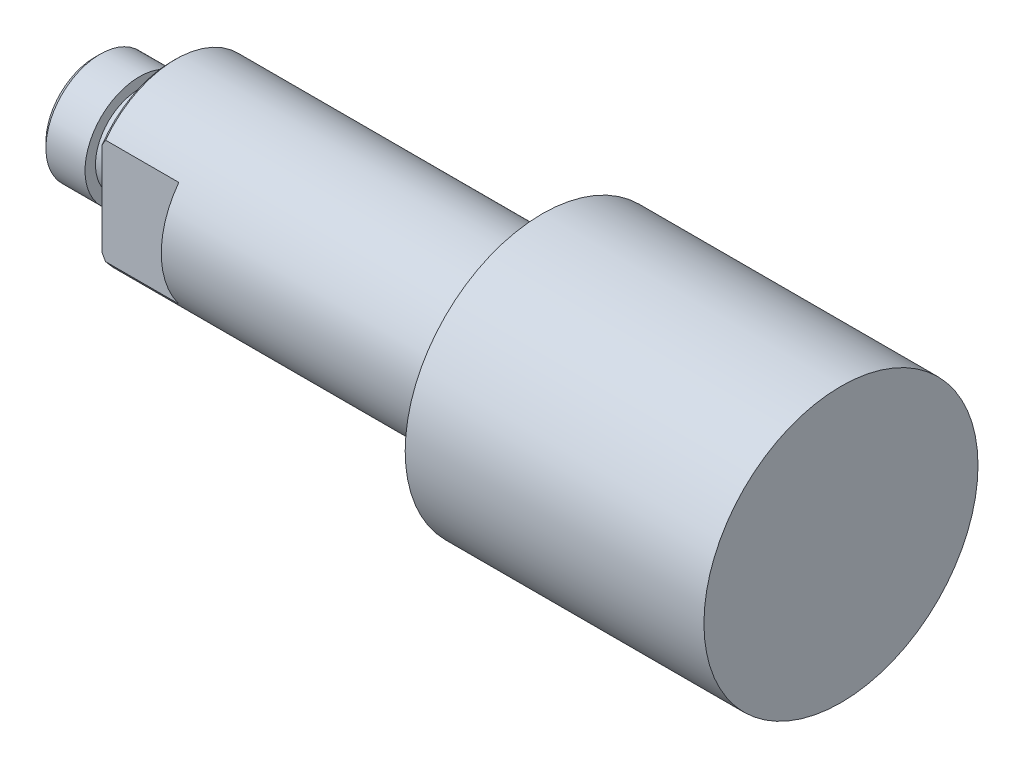
ISO-10303-21;
HEADER;
FILE_DESCRIPTION(('STEP AP214'),'2;1');
FILE_NAME('part.step','',(''),(''),'','','');
FILE_SCHEMA(('AUTOMOTIVE_DESIGN { 1 0 10303 214 1 1 1 1 }'));
ENDSEC;
DATA;
#1=APPLICATION_CONTEXT('core data for automotive mechanical design processes');
#2=APPLICATION_PROTOCOL_DEFINITION('international standard','automotive_design',2000,#1);
#3=PRODUCT_CONTEXT('',#1,'mechanical');
#4=PRODUCT('Part','Part','',(#3));
#5=PRODUCT_RELATED_PRODUCT_CATEGORY('part','',(#4));
#6=PRODUCT_DEFINITION_FORMATION('','',#4);
#7=PRODUCT_DEFINITION_CONTEXT('part definition',#1,'design');
#8=PRODUCT_DEFINITION('design','',#6,#7);
#9=PRODUCT_DEFINITION_SHAPE('','',#8);
#10=(LENGTH_UNIT() NAMED_UNIT(*) SI_UNIT(.MILLI.,.METRE.));
#11=(NAMED_UNIT(*) PLANE_ANGLE_UNIT() SI_UNIT($,.RADIAN.));
#12=(NAMED_UNIT(*) SI_UNIT($,.STERADIAN.) SOLID_ANGLE_UNIT());
#13=UNCERTAINTY_MEASURE_WITH_UNIT(LENGTH_MEASURE(1.E-05),#10,'distance_accuracy_value','');
#14=(GEOMETRIC_REPRESENTATION_CONTEXT(3) GLOBAL_UNCERTAINTY_ASSIGNED_CONTEXT((#13)) GLOBAL_UNIT_ASSIGNED_CONTEXT((#10,
#11,#12)) REPRESENTATION_CONTEXT('',''));
#15=CARTESIAN_POINT('',(0.,0.,0.));
#16=DIRECTION('',(0.,0.,1.));
#17=DIRECTION('',(1.,0.,0.));
#18=AXIS2_PLACEMENT_3D('',#15,#16,#17);
#19=CARTESIAN_POINT('',(7.,0.,0.));
#20=DIRECTION('',(1.,0.,0.));
#21=DIRECTION('',(0.,1.,0.));
#22=AXIS2_PLACEMENT_3D('',#19,#20,#21);
#23=PLANE('',#22);
#24=DIRECTION('',(0.,-1.,0.));
#25=VECTOR('',#24,1.);
#26=CARTESIAN_POINT('',(7.,8.,6.4));
#27=LINE('',#26,#25);
#28=CARTESIAN_POINT('',(7.,4.8,6.4));
#29=VERTEX_POINT('',#28);
#30=CARTESIAN_POINT('',(7.,-4.8,6.4));
#31=VERTEX_POINT('',#30);
#32=EDGE_CURVE('E11',#29,#31,#27,.T.);
#33=ORIENTED_EDGE('',*,*,#32,.T.);
#34=CARTESIAN_POINT('',(7.,0.,0.));
#35=DIRECTION('',(1.,0.,0.));
#36=DIRECTION('',(0.,0.,-1.));
#37=AXIS2_PLACEMENT_3D('',#34,#35,#36);
#38=CIRCLE('',#37,8.);
#39=EDGE_CURVE('E192',#29,#31,#38,.T.);
#40=ORIENTED_EDGE('',*,*,#39,.F.);
#41=EDGE_LOOP('',(#33,#40));
#42=FACE_BOUND('',#41,.T.);
#43=ADVANCED_FACE('F16',(#42),#23,.F.);
#44=CARTESIAN_POINT('',(7.,8.,6.4));
#45=DIRECTION('',(0.,0.,-1.));
#46=DIRECTION('',(0.,-1.,0.));
#47=AXIS2_PLACEMENT_3D('',#44,#45,#46);
#48=PLANE('',#47);
#49=DIRECTION('',(0.,-1.,0.));
#50=VECTOR('',#49,1.);
#51=CARTESIAN_POINT('',(0.,8.,6.4));
#52=LINE('',#51,#50);
#53=CARTESIAN_POINT('',(0.,4.24527973165491,6.4));
#54=VERTEX_POINT('',#53);
#55=CARTESIAN_POINT('',(0.,-4.24527973165491,6.4));
#56=VERTEX_POINT('',#55);
#57=EDGE_CURVE('E181',#54,#56,#52,.T.);
#58=ORIENTED_EDGE('',*,*,#57,.T.);
#59=CARTESIAN_POINT('',(0.32,-4.8,6.4));
#60=CARTESIAN_POINT('',(0.20996321902832,-4.6166053650472,6.4));
#61=CARTESIAN_POINT('',(0.103096522960072,-4.43178835920881,6.4));
#62=CARTESIAN_POINT('',(0.,-4.24527973165491,6.4));
#63=(BOUNDED_CURVE() B_SPLINE_CURVE(3,(#59,#60,#61,#62),.UNSPECIFIED.,.F.,
.F.) B_SPLINE_CURVE_WITH_KNOTS((4,4),(1.35090557365412E-06,0.000638458369954126),
.UNSPECIFIED.) CURVE() GEOMETRIC_REPRESENTATION_ITEM() RATIONAL_B_SPLINE_CURVE((1.,1.,1.,1.)) REPRESENTATION_ITEM(''));
#64=CARTESIAN_POINT('',(0.32,-4.8,6.4));
#65=VERTEX_POINT('',#64);
#66=EDGE_CURVE('E344',#65,#56,#63,.T.);
#67=ORIENTED_EDGE('',*,*,#66,.F.);
#68=DIRECTION('',(-1.,0.,0.));
#69=VECTOR('',#68,1.);
#70=CARTESIAN_POINT('',(61.,-4.8,6.4));
#71=LINE('',#70,#69);
#72=EDGE_CURVE('E185',#31,#65,#71,.T.);
#73=ORIENTED_EDGE('',*,*,#72,.F.);
#74=ORIENTED_EDGE('',*,*,#32,.F.);
#75=DIRECTION('',(1.,0.,0.));
#76=VECTOR('',#75,1.);
#77=CARTESIAN_POINT('',(61.,4.8,6.4));
#78=LINE('',#77,#76);
#79=CARTESIAN_POINT('',(0.32,4.8,6.4));
#80=VERTEX_POINT('',#79);
#81=EDGE_CURVE('E222',#80,#29,#78,.T.);
#82=ORIENTED_EDGE('',*,*,#81,.F.);
#83=CARTESIAN_POINT('',(0.,4.24527973165494,6.4));
#84=CARTESIAN_POINT('',(0.10318239744357,4.43194371199482,6.4));
#85=CARTESIAN_POINT('',(0.210049599241936,4.61674933206989,6.4));
#86=CARTESIAN_POINT('',(0.32,4.8,6.4));
#87=(BOUNDED_CURVE() B_SPLINE_CURVE(3,(#83,#84,#85,#86),.UNSPECIFIED.,.F.,
.F.) B_SPLINE_CURVE_WITH_KNOTS((4,4),(0.00955860477936685,0.0101932153989926),
.UNSPECIFIED.) CURVE() GEOMETRIC_REPRESENTATION_ITEM() RATIONAL_B_SPLINE_CURVE((1.,1.,1.,1.)) REPRESENTATION_ITEM(''));
#88=EDGE_CURVE('E151',#54,#80,#87,.T.);
#89=ORIENTED_EDGE('',*,*,#88,.F.);
#90=EDGE_LOOP('',(#58,#67,#73,#74,#82,#89));
#91=FACE_BOUND('',#90,.T.);
#92=ADVANCED_FACE('F279',(#91),#48,.F.);
#93=CARTESIAN_POINT('',(7.,-8.,-6.4));
#94=DIRECTION('',(0.,0.,1.));
#95=DIRECTION('',(1.,0.,0.));
#96=AXIS2_PLACEMENT_3D('',#93,#94,#95);
#97=PLANE('',#96);
#98=DIRECTION('',(0.,1.,0.));
#99=VECTOR('',#98,1.);
#100=CARTESIAN_POINT('',(0.,-8.,-6.4));
#101=LINE('',#100,#99);
#102=CARTESIAN_POINT('',(0.,-4.24527973165491,-6.4));
#103=VERTEX_POINT('',#102);
#104=CARTESIAN_POINT('',(0.,4.24527973165491,-6.4));
#105=VERTEX_POINT('',#104);
#106=EDGE_CURVE('E144',#103,#105,#101,.T.);
#107=ORIENTED_EDGE('',*,*,#106,.T.);
#108=CARTESIAN_POINT('',(0.32,4.8,-6.4));
#109=CARTESIAN_POINT('',(0.20996321902832,4.6166053650472,-6.4));
#110=CARTESIAN_POINT('',(0.103096522960072,4.43178835920881,-6.4));
#111=CARTESIAN_POINT('',(0.,4.24527973165491,-6.4));
#112=(BOUNDED_CURVE() B_SPLINE_CURVE(3,(#108,#109,#110,#111),.UNSPECIFIED.,.F.,
.F.) B_SPLINE_CURVE_WITH_KNOTS((4,4),(1.35090557365412E-06,0.000638458369954126),
.UNSPECIFIED.) CURVE() GEOMETRIC_REPRESENTATION_ITEM() RATIONAL_B_SPLINE_CURVE((1.,1.,1.,1.)) REPRESENTATION_ITEM(''));
#113=CARTESIAN_POINT('',(0.32,4.8,-6.4));
#114=VERTEX_POINT('',#113);
#115=EDGE_CURVE('E20',#114,#105,#112,.T.);
#116=ORIENTED_EDGE('',*,*,#115,.F.);
#117=DIRECTION('',(-1.,0.,0.));
#118=VECTOR('',#117,1.);
#119=CARTESIAN_POINT('',(61.,4.8,-6.4));
#120=LINE('',#119,#118);
#121=CARTESIAN_POINT('',(7.,4.8,-6.4));
#122=VERTEX_POINT('',#121);
#123=EDGE_CURVE('E122',#122,#114,#120,.T.);
#124=ORIENTED_EDGE('',*,*,#123,.F.);
#125=DIRECTION('',(0.,1.,0.));
#126=VECTOR('',#125,1.);
#127=CARTESIAN_POINT('',(7.,-8.,-6.4));
#128=LINE('',#127,#126);
#129=CARTESIAN_POINT('',(7.,-4.8,-6.4));
#130=VERTEX_POINT('',#129);
#131=EDGE_CURVE('E29',#130,#122,#128,.T.);
#132=ORIENTED_EDGE('',*,*,#131,.F.);
#133=DIRECTION('',(1.,0.,0.));
#134=VECTOR('',#133,1.);
#135=CARTESIAN_POINT('',(61.,-4.8,-6.4));
#136=LINE('',#135,#134);
#137=CARTESIAN_POINT('',(0.32,-4.8,-6.4));
#138=VERTEX_POINT('',#137);
#139=EDGE_CURVE('E191',#138,#130,#136,.T.);
#140=ORIENTED_EDGE('',*,*,#139,.F.);
#141=CARTESIAN_POINT('',(0.,-4.24527973165494,-6.4));
#142=CARTESIAN_POINT('',(0.10318239744357,-4.43194371199482,-6.4));
#143=CARTESIAN_POINT('',(0.210049599241936,-4.61674933206989,-6.4));
#144=CARTESIAN_POINT('',(0.32,-4.8,-6.4));
#145=(BOUNDED_CURVE() B_SPLINE_CURVE(3,(#141,#142,#143,#144),.UNSPECIFIED.,.F.,
.F.) B_SPLINE_CURVE_WITH_KNOTS((4,4),(0.00955860477936685,0.0101932153989926),
.UNSPECIFIED.) CURVE() GEOMETRIC_REPRESENTATION_ITEM() RATIONAL_B_SPLINE_CURVE((1.,1.,1.,1.)) REPRESENTATION_ITEM(''));
#146=EDGE_CURVE('E327',#103,#138,#145,.T.);
#147=ORIENTED_EDGE('',*,*,#146,.F.);
#148=EDGE_LOOP('',(#107,#116,#124,#132,#140,#147));
#149=FACE_BOUND('',#148,.T.);
#150=ADVANCED_FACE('F141',(#149),#97,.F.);
#151=CARTESIAN_POINT('',(7.,0.,0.));
#152=DIRECTION('',(1.,0.,0.));
#153=DIRECTION('',(0.,1.,0.));
#154=AXIS2_PLACEMENT_3D('',#151,#152,#153);
#155=PLANE('',#154);
#156=ORIENTED_EDGE('',*,*,#131,.T.);
#157=CARTESIAN_POINT('',(7.,0.,0.));
#158=DIRECTION('',(1.,0.,0.));
#159=DIRECTION('',(0.,0.,-1.));
#160=AXIS2_PLACEMENT_3D('',#157,#158,#159);
#161=CIRCLE('',#160,8.);
#162=EDGE_CURVE('E133',#130,#122,#161,.T.);
#163=ORIENTED_EDGE('',*,*,#162,.F.);
#164=EDGE_LOOP('',(#156,#163));
#165=FACE_BOUND('',#164,.T.);
#166=ADVANCED_FACE('F307',(#165),#155,.F.);
#167=CARTESIAN_POINT('',(-4.6256,0.,0.));
#168=DIRECTION('',(-1.,0.,0.));
#169=DIRECTION('',(0.,0.,1.));
#170=AXIS2_PLACEMENT_3D('',#167,#168,#169);
#171=PLANE('',#170);
#172=DIRECTION('',(0.,0.,1.));
#173=VECTOR('',#172,1.);
#174=CARTESIAN_POINT('',(-4.6256,-2.5,-1.44337567297406));
#175=LINE('',#174,#173);
#176=CARTESIAN_POINT('',(-4.6256,-2.5,-1.44337567297406));
#177=VERTEX_POINT('',#176);
#178=CARTESIAN_POINT('',(-4.6256,-2.5,1.44337567297406));
#179=VERTEX_POINT('',#178);
#180=EDGE_CURVE('E166',#177,#179,#175,.T.);
#181=ORIENTED_EDGE('',*,*,#180,.T.);
#182=DIRECTION('',(0.,0.866025403784439,0.5));
#183=VECTOR('',#182,1.);
#184=CARTESIAN_POINT('',(-4.6256,-2.5,1.44337567297406));
#185=LINE('',#184,#183);
#186=CARTESIAN_POINT('',(-4.6256,0.,2.88675134594813));
#187=VERTEX_POINT('',#186);
#188=EDGE_CURVE('E70',#179,#187,#185,.T.);
#189=ORIENTED_EDGE('',*,*,#188,.T.);
#190=DIRECTION('',(0.,0.866025403784439,-0.5));
#191=VECTOR('',#190,1.);
#192=CARTESIAN_POINT('',(-4.6256,0.,2.88675134594813));
#193=LINE('',#192,#191);
#194=CARTESIAN_POINT('',(-4.6256,2.5,1.44337567297406));
#195=VERTEX_POINT('',#194);
#196=EDGE_CURVE('E228',#187,#195,#193,.T.);
#197=ORIENTED_EDGE('',*,*,#196,.T.);
#198=DIRECTION('',(0.,0.,-1.));
#199=VECTOR('',#198,1.);
#200=CARTESIAN_POINT('',(-4.6256,2.5,1.44337567297406));
#201=LINE('',#200,#199);
#202=CARTESIAN_POINT('',(-4.6256,2.5,-1.44337567297406));
#203=VERTEX_POINT('',#202);
#204=EDGE_CURVE('E197',#195,#203,#201,.T.);
#205=ORIENTED_EDGE('',*,*,#204,.T.);
#206=DIRECTION('',(0.,-0.866025403784439,-0.5));
#207=VECTOR('',#206,1.);
#208=CARTESIAN_POINT('',(-4.6256,2.5,-1.44337567297406));
#209=LINE('',#208,#207);
#210=CARTESIAN_POINT('',(-4.6256,0.,-2.88675134594813));
#211=VERTEX_POINT('',#210);
#212=EDGE_CURVE('E170',#203,#211,#209,.T.);
#213=ORIENTED_EDGE('',*,*,#212,.T.);
#214=DIRECTION('',(0.,-0.866025403784439,0.5));
#215=VECTOR('',#214,1.);
#216=CARTESIAN_POINT('',(-4.6256,0.,-2.88675134594813));
#217=LINE('',#216,#215);
#218=EDGE_CURVE('E43',#211,#177,#217,.T.);
#219=ORIENTED_EDGE('',*,*,#218,.T.);
#220=EDGE_LOOP('',(#181,#189,#197,#205,#213,#219));
#221=FACE_BOUND('',#220,.T.);
#222=ADVANCED_FACE('F305',(#221),#171,.T.);
#223=CARTESIAN_POINT('',(-4.6256,0.,-2.88675134594813));
#224=DIRECTION('',(0.,-0.5,-0.866025403784439));
#225=DIRECTION('',(0.,-0.866025403784439,0.5));
#226=AXIS2_PLACEMENT_3D('',#223,#224,#225);
#227=PLANE('',#226);
#228=DIRECTION('',(0.,-0.866025403784439,0.5));
#229=VECTOR('',#228,1.);
#230=CARTESIAN_POINT('',(-7.064,0.,-2.88675134594813));
#231=LINE('',#230,#229);
#232=CARTESIAN_POINT('',(-7.064,0.,-2.88675134594813));
#233=VERTEX_POINT('',#232);
#234=CARTESIAN_POINT('',(-7.064,-2.5,-1.44337567297406));
#235=VERTEX_POINT('',#234);
#236=EDGE_CURVE('E211',#233,#235,#231,.T.);
#237=ORIENTED_EDGE('',*,*,#236,.T.);
#238=DIRECTION('',(-1.,0.,0.));
#239=VECTOR('',#238,1.);
#240=CARTESIAN_POINT('',(-4.6256,-2.5,-1.44337567297406));
#241=LINE('',#240,#239);
#242=EDGE_CURVE('E202',#177,#235,#241,.T.);
#243=ORIENTED_EDGE('',*,*,#242,.F.);
#244=ORIENTED_EDGE('',*,*,#218,.F.);
#245=DIRECTION('',(-1.,0.,0.));
#246=VECTOR('',#245,1.);
#247=CARTESIAN_POINT('',(-4.6256,0.,-2.88675134594813));
#248=LINE('',#247,#246);
#249=EDGE_CURVE('E194',#211,#233,#248,.T.);
#250=ORIENTED_EDGE('',*,*,#249,.T.);
#251=EDGE_LOOP('',(#237,#243,#244,#250));
#252=FACE_BOUND('',#251,.T.);
#253=ADVANCED_FACE('F299',(#252),#227,.F.);
#254=CARTESIAN_POINT('',(-4.6256,2.5,-1.44337567297406));
#255=DIRECTION('',(0.,0.5,-0.866025403784439));
#256=DIRECTION('',(-1.,0.,0.));
#257=AXIS2_PLACEMENT_3D('',#254,#255,#256);
#258=PLANE('',#257);
#259=DIRECTION('',(0.,-0.866025403784439,-0.5));
#260=VECTOR('',#259,1.);
#261=CARTESIAN_POINT('',(-7.064,2.5,-1.44337567297406));
#262=LINE('',#261,#260);
#263=CARTESIAN_POINT('',(-7.064,2.5,-1.44337567297406));
#264=VERTEX_POINT('',#263);
#265=EDGE_CURVE('E215',#264,#233,#262,.T.);
#266=ORIENTED_EDGE('',*,*,#265,.T.);
#267=ORIENTED_EDGE('',*,*,#249,.F.);
#268=ORIENTED_EDGE('',*,*,#212,.F.);
#269=DIRECTION('',(-1.,0.,0.));
#270=VECTOR('',#269,1.);
#271=CARTESIAN_POINT('',(-4.6256,2.5,-1.44337567297406));
#272=LINE('',#271,#270);
#273=EDGE_CURVE('E240',#203,#264,#272,.T.);
#274=ORIENTED_EDGE('',*,*,#273,.T.);
#275=EDGE_LOOP('',(#266,#267,#268,#274));
#276=FACE_BOUND('',#275,.T.);
#277=ADVANCED_FACE('F296',(#276),#258,.F.);
#278=CARTESIAN_POINT('',(-4.6256,2.5,1.44337567297406));
#279=DIRECTION('',(0.,1.,0.));
#280=DIRECTION('',(1.,0.,0.));
#281=AXIS2_PLACEMENT_3D('',#278,#279,#280);
#282=PLANE('',#281);
#283=DIRECTION('',(-1.,0.,0.));
#284=VECTOR('',#283,1.);
#285=CARTESIAN_POINT('',(-4.6256,2.5,1.44337567297406));
#286=LINE('',#285,#284);
#287=CARTESIAN_POINT('',(-7.064,2.5,1.44337567297406));
#288=VERTEX_POINT('',#287);
#289=EDGE_CURVE('E225',#195,#288,#286,.T.);
#290=ORIENTED_EDGE('',*,*,#289,.T.);
#291=DIRECTION('',(0.,0.,1.));
#292=VECTOR('',#291,1.);
#293=CARTESIAN_POINT('',(-7.064,2.5,0.));
#294=LINE('',#293,#292);
#295=EDGE_CURVE('E355',#264,#288,#294,.T.);
#296=ORIENTED_EDGE('',*,*,#295,.F.);
#297=ORIENTED_EDGE('',*,*,#273,.F.);
#298=ORIENTED_EDGE('',*,*,#204,.F.);
#299=EDGE_LOOP('',(#290,#296,#297,#298));
#300=FACE_BOUND('',#299,.T.);
#301=ADVANCED_FACE('F294',(#300),#282,.F.);
#302=CARTESIAN_POINT('',(-4.6256,0.,2.88675134594813));
#303=DIRECTION('',(0.,0.5,0.866025403784439));
#304=DIRECTION('',(1.,0.,0.));
#305=AXIS2_PLACEMENT_3D('',#302,#303,#304);
#306=PLANE('',#305);
#307=DIRECTION('',(0.,0.866025403784439,-0.5));
#308=VECTOR('',#307,1.);
#309=CARTESIAN_POINT('',(-7.064,0.,2.88675134594813));
#310=LINE('',#309,#308);
#311=CARTESIAN_POINT('',(-7.064,0.,2.88675134594813));
#312=VERTEX_POINT('',#311);
#313=EDGE_CURVE('E174',#312,#288,#310,.T.);
#314=ORIENTED_EDGE('',*,*,#313,.T.);
#315=ORIENTED_EDGE('',*,*,#289,.F.);
#316=ORIENTED_EDGE('',*,*,#196,.F.);
#317=DIRECTION('',(-1.,0.,0.));
#318=VECTOR('',#317,1.);
#319=CARTESIAN_POINT('',(-4.6256,0.,2.88675134594813));
#320=LINE('',#319,#318);
#321=EDGE_CURVE('E242',#187,#312,#320,.T.);
#322=ORIENTED_EDGE('',*,*,#321,.T.);
#323=EDGE_LOOP('',(#314,#315,#316,#322));
#324=FACE_BOUND('',#323,.T.);
#325=ADVANCED_FACE('F291',(#324),#306,.F.);
#326=CARTESIAN_POINT('',(-4.6256,-2.5,1.44337567297406));
#327=DIRECTION('',(0.,-0.5,0.866025403784439));
#328=DIRECTION('',(-1.,0.,0.));
#329=AXIS2_PLACEMENT_3D('',#326,#327,#328);
#330=PLANE('',#329);
#331=DIRECTION('',(0.,0.866025403784439,0.5));
#332=VECTOR('',#331,1.);
#333=CARTESIAN_POINT('',(-7.064,-2.5,1.44337567297406));
#334=LINE('',#333,#332);
#335=CARTESIAN_POINT('',(-7.064,-2.5,1.44337567297406));
#336=VERTEX_POINT('',#335);
#337=EDGE_CURVE('E162',#336,#312,#334,.T.);
#338=ORIENTED_EDGE('',*,*,#337,.T.);
#339=ORIENTED_EDGE('',*,*,#321,.F.);
#340=ORIENTED_EDGE('',*,*,#188,.F.);
#341=DIRECTION('',(-1.,0.,0.));
#342=VECTOR('',#341,1.);
#343=CARTESIAN_POINT('',(-4.6256,-2.5,1.44337567297406));
#344=LINE('',#343,#342);
#345=EDGE_CURVE('E164',#179,#336,#344,.T.);
#346=ORIENTED_EDGE('',*,*,#345,.T.);
#347=EDGE_LOOP('',(#338,#339,#340,#346));
#348=FACE_BOUND('',#347,.T.);
#349=ADVANCED_FACE('F273',(#348),#330,.F.);
#350=CARTESIAN_POINT('',(-4.6256,-2.5,-1.44337567297406));
#351=DIRECTION('',(0.,-1.,0.));
#352=DIRECTION('',(0.,0.,-1.));
#353=AXIS2_PLACEMENT_3D('',#350,#351,#352);
#354=PLANE('',#353);
#355=DIRECTION('',(0.,0.,1.));
#356=VECTOR('',#355,1.);
#357=CARTESIAN_POINT('',(-7.064,-2.5,-1.44337567297406));
#358=LINE('',#357,#356);
#359=EDGE_CURVE('E216',#235,#336,#358,.T.);
#360=ORIENTED_EDGE('',*,*,#359,.T.);
#361=ORIENTED_EDGE('',*,*,#345,.F.);
#362=ORIENTED_EDGE('',*,*,#180,.F.);
#363=ORIENTED_EDGE('',*,*,#242,.T.);
#364=EDGE_LOOP('',(#360,#361,#362,#363));
#365=FACE_BOUND('',#364,.T.);
#366=ADVANCED_FACE('F263',(#365),#354,.F.);
#367=CARTESIAN_POINT('',(-3.,4.953,0.));
#368=DIRECTION('',(-1.,0.,0.));
#369=DIRECTION('',(0.,0.,1.));
#370=AXIS2_PLACEMENT_3D('',#367,#368,#369);
#371=PLANE('',#370);
#372=CARTESIAN_POINT('',(-3.,0.,0.));
#373=DIRECTION('',(1.,0.,0.));
#374=DIRECTION('',(0.,0.,-1.));
#375=AXIS2_PLACEMENT_3D('',#372,#373,#374);
#376=CIRCLE('',#375,4.953);
#377=CARTESIAN_POINT('',(-3.,0.,-4.953));
#378=VERTEX_POINT('',#377);
#379=EDGE_CURVE('E84',#378,#378,#376,.T.);
#380=ORIENTED_EDGE('',*,*,#379,.T.);
#381=EDGE_LOOP('',(#380));
#382=FACE_BOUND('',#381,.T.);
#383=CARTESIAN_POINT('',(-3.,0.,0.));
#384=DIRECTION('',(1.,0.,0.));
#385=DIRECTION('',(0.,0.,-1.));
#386=AXIS2_PLACEMENT_3D('',#383,#384,#385);
#387=CIRCLE('',#386,4.);
#388=CARTESIAN_POINT('',(-3.,0.,-4.));
#389=VERTEX_POINT('',#388);
#390=EDGE_CURVE('E206',#389,#389,#387,.T.);
#391=ORIENTED_EDGE('',*,*,#390,.F.);
#392=EDGE_LOOP('',(#391));
#393=FACE_BOUND('',#392,.T.);
#394=ADVANCED_FACE('F260',(#382,#393),#371,.F.);
#395=CARTESIAN_POINT('',(17.,0.,0.));
#396=DIRECTION('',(1.,0.,0.));
#397=DIRECTION('',(0.,0.,-1.));
#398=AXIS2_PLACEMENT_3D('',#395,#396,#397);
#399=CYLINDRICAL_SURFACE('',#398,4.953);
#400=CARTESIAN_POINT('',(-6.5687,0.,0.));
#401=DIRECTION('',(1.,0.,0.));
#402=DIRECTION('',(0.,0.,-1.));
#403=AXIS2_PLACEMENT_3D('',#400,#401,#402);
#404=CIRCLE('',#403,4.953);
#405=CARTESIAN_POINT('',(-6.5687,0.,-4.953));
#406=VERTEX_POINT('',#405);
#407=EDGE_CURVE('E219',#406,#406,#404,.T.);
#408=ORIENTED_EDGE('',*,*,#407,.T.);
#409=EDGE_LOOP('',(#408));
#410=FACE_BOUND('',#409,.T.);
#411=ORIENTED_EDGE('',*,*,#379,.F.);
#412=EDGE_LOOP('',(#411));
#413=FACE_BOUND('',#412,.T.);
#414=ADVANCED_FACE('F262',(#410,#413),#399,.T.);
#415=CARTESIAN_POINT('',(-7.064,0.,0.));
#416=DIRECTION('',(1.,0.,0.));
#417=DIRECTION('',(0.,0.,-1.));
#418=AXIS2_PLACEMENT_3D('',#415,#416,#417);
#419=CONICAL_SURFACE('',#418,4.4577,0.785398163397448);
#420=CARTESIAN_POINT('',(-7.064,0.,0.));
#421=DIRECTION('',(1.,0.,0.));
#422=DIRECTION('',(0.,0.,-1.));
#423=AXIS2_PLACEMENT_3D('',#420,#421,#422);
#424=CIRCLE('',#423,4.4577);
#425=CARTESIAN_POINT('',(-7.064,0.,-4.4577));
#426=VERTEX_POINT('',#425);
#427=EDGE_CURVE('E178',#426,#426,#424,.T.);
#428=ORIENTED_EDGE('',*,*,#427,.T.);
#429=EDGE_LOOP('',(#428));
#430=FACE_BOUND('',#429,.T.);
#431=ORIENTED_EDGE('',*,*,#407,.F.);
#432=EDGE_LOOP('',(#431));
#433=FACE_BOUND('',#432,.T.);
#434=ADVANCED_FACE('F270',(#430,#433),#419,.T.);
#435=CARTESIAN_POINT('',(-7.064,0.,0.));
#436=DIRECTION('',(1.,0.,0.));
#437=DIRECTION('',(0.,1.,0.));
#438=AXIS2_PLACEMENT_3D('',#435,#436,#437);
#439=PLANE('',#438);
#440=ORIENTED_EDGE('',*,*,#313,.F.);
#441=ORIENTED_EDGE('',*,*,#337,.F.);
#442=ORIENTED_EDGE('',*,*,#359,.F.);
#443=ORIENTED_EDGE('',*,*,#236,.F.);
#444=ORIENTED_EDGE('',*,*,#265,.F.);
#445=ORIENTED_EDGE('',*,*,#295,.T.);
#446=EDGE_LOOP('',(#440,#441,#442,#443,#444,#445));
#447=FACE_BOUND('',#446,.T.);
#448=ORIENTED_EDGE('',*,*,#427,.F.);
#449=EDGE_LOOP('',(#448));
#450=FACE_BOUND('',#449,.T.);
#451=ADVANCED_FACE('F289',(#447,#450),#439,.F.);
#452=CARTESIAN_POINT('',(17.,0.,0.));
#453=DIRECTION('',(1.,0.,0.));
#454=DIRECTION('',(0.,0.,-1.));
#455=AXIS2_PLACEMENT_3D('',#452,#453,#454);
#456=CYLINDRICAL_SURFACE('',#455,4.);
#457=ORIENTED_EDGE('',*,*,#390,.T.);
#458=EDGE_LOOP('',(#457));
#459=FACE_BOUND('',#458,.T.);
#460=CARTESIAN_POINT('',(0.,0.,0.));
#461=DIRECTION('',(-1.,0.,0.));
#462=DIRECTION('',(0.,0.,-1.));
#463=AXIS2_PLACEMENT_3D('',#460,#461,#462);
#464=CIRCLE('',#463,4.);
#465=CARTESIAN_POINT('',(0.,0.,-4.));
#466=VERTEX_POINT('',#465);
#467=EDGE_CURVE('E158',#466,#466,#464,.T.);
#468=ORIENTED_EDGE('',*,*,#467,.T.);
#469=EDGE_LOOP('',(#468));
#470=FACE_BOUND('',#469,.T.);
#471=ADVANCED_FACE('F257',(#459,#470),#456,.T.);
#472=CARTESIAN_POINT('',(61.,12.5,0.));
#473=DIRECTION('',(-1.,0.,0.));
#474=DIRECTION('',(0.,0.,1.));
#475=AXIS2_PLACEMENT_3D('',#472,#473,#474);
#476=PLANE('',#475);
#477=CARTESIAN_POINT('',(61.,0.,0.));
#478=DIRECTION('',(1.,0.,0.));
#479=DIRECTION('',(0.,0.,-1.));
#480=AXIS2_PLACEMENT_3D('',#477,#478,#479);
#481=CIRCLE('',#480,12.5);
#482=CARTESIAN_POINT('',(61.,0.,-12.5));
#483=VERTEX_POINT('',#482);
#484=EDGE_CURVE('E207',#483,#483,#481,.T.);
#485=ORIENTED_EDGE('',*,*,#484,.T.);
#486=EDGE_LOOP('',(#485));
#487=FACE_BOUND('',#486,.T.);
#488=ADVANCED_FACE('F18',(#487),#476,.F.);
#489=CARTESIAN_POINT('',(61.,0.,0.));
#490=DIRECTION('',(1.,0.,0.));
#491=DIRECTION('',(0.,0.,-1.));
#492=AXIS2_PLACEMENT_3D('',#489,#490,#491);
#493=CYLINDRICAL_SURFACE('',#492,12.5);
#494=CARTESIAN_POINT('',(33.75,0.,0.));
#495=DIRECTION('',(1.,0.,0.));
#496=DIRECTION('',(0.,0.,-1.));
#497=AXIS2_PLACEMENT_3D('',#494,#495,#496);
#498=CIRCLE('',#497,12.5);
#499=CARTESIAN_POINT('',(33.75,0.,-12.5));
#500=VERTEX_POINT('',#499);
#501=EDGE_CURVE('E137',#500,#500,#498,.T.);
#502=ORIENTED_EDGE('',*,*,#501,.T.);
#503=EDGE_LOOP('',(#502));
#504=FACE_BOUND('',#503,.T.);
#505=ORIENTED_EDGE('',*,*,#484,.F.);
#506=EDGE_LOOP('',(#505));
#507=FACE_BOUND('',#506,.T.);
#508=ADVANCED_FACE('F304',(#504,#507),#493,.T.);
#509=CARTESIAN_POINT('',(33.75,8.,0.));
#510=DIRECTION('',(1.,0.,0.));
#511=DIRECTION('',(0.,1.,0.));
#512=AXIS2_PLACEMENT_3D('',#509,#510,#511);
#513=PLANE('',#512);
#514=CARTESIAN_POINT('',(33.75,0.,0.));
#515=DIRECTION('',(1.,0.,0.));
#516=DIRECTION('',(0.,0.,-1.));
#517=AXIS2_PLACEMENT_3D('',#514,#515,#516);
#518=CIRCLE('',#517,8.);
#519=CARTESIAN_POINT('',(33.75,0.,-8.));
#520=VERTEX_POINT('',#519);
#521=EDGE_CURVE('E114',#520,#520,#518,.T.);
#522=ORIENTED_EDGE('',*,*,#521,.T.);
#523=EDGE_LOOP('',(#522));
#524=FACE_BOUND('',#523,.T.);
#525=ORIENTED_EDGE('',*,*,#501,.F.);
#526=EDGE_LOOP('',(#525));
#527=FACE_BOUND('',#526,.T.);
#528=ADVANCED_FACE('F301',(#524,#527),#513,.F.);
#529=CARTESIAN_POINT('',(61.,0.,0.));
#530=DIRECTION('',(1.,0.,0.));
#531=DIRECTION('',(0.,0.,-1.));
#532=AXIS2_PLACEMENT_3D('',#529,#530,#531);
#533=CYLINDRICAL_SURFACE('',#532,8.);
#534=CARTESIAN_POINT('',(0.32,0.,0.));
#535=DIRECTION('',(1.,0.,0.));
#536=DIRECTION('',(0.,0.,-1.));
#537=AXIS2_PLACEMENT_3D('',#534,#535,#536);
#538=CIRCLE('',#537,8.);
#539=EDGE_CURVE('E128',#114,#80,#538,.T.);
#540=ORIENTED_EDGE('',*,*,#539,.T.);
#541=ORIENTED_EDGE('',*,*,#81,.T.);
#542=ORIENTED_EDGE('',*,*,#39,.T.);
#543=ORIENTED_EDGE('',*,*,#72,.T.);
#544=CARTESIAN_POINT('',(0.32,0.,0.));
#545=DIRECTION('',(1.,0.,0.));
#546=DIRECTION('',(0.,0.,-1.));
#547=AXIS2_PLACEMENT_3D('',#544,#545,#546);
#548=CIRCLE('',#547,8.);
#549=EDGE_CURVE('E340',#65,#138,#548,.T.);
#550=ORIENTED_EDGE('',*,*,#549,.T.);
#551=ORIENTED_EDGE('',*,*,#139,.T.);
#552=ORIENTED_EDGE('',*,*,#162,.T.);
#553=ORIENTED_EDGE('',*,*,#123,.T.);
#554=EDGE_LOOP('',(#540,#541,#542,#543,#550,#551,#552,#553));
#555=FACE_BOUND('',#554,.T.);
#556=ORIENTED_EDGE('',*,*,#521,.F.);
#557=EDGE_LOOP('',(#556));
#558=FACE_BOUND('',#557,.T.);
#559=ADVANCED_FACE('F124',(#555,#558),#533,.T.);
#560=CARTESIAN_POINT('',(0.,0.,0.));
#561=DIRECTION('',(1.,0.,0.));
#562=DIRECTION('',(0.,0.,-1.));
#563=AXIS2_PLACEMENT_3D('',#560,#561,#562);
#564=CONICAL_SURFACE('',#563,7.68,0.785398163397447);
#565=CARTESIAN_POINT('',(0.,0.,0.));
#566=DIRECTION('',(1.,0.,0.));
#567=DIRECTION('',(0.,0.,-1.));
#568=AXIS2_PLACEMENT_3D('',#565,#566,#567);
#569=CIRCLE('',#568,7.68);
#570=EDGE_CURVE('E322',#105,#54,#569,.T.);
#571=ORIENTED_EDGE('',*,*,#570,.T.);
#572=ORIENTED_EDGE('',*,*,#88,.T.);
#573=ORIENTED_EDGE('',*,*,#539,.F.);
#574=ORIENTED_EDGE('',*,*,#115,.T.);
#575=EDGE_LOOP('',(#571,#572,#573,#574));
#576=FACE_BOUND('',#575,.T.);
#577=ADVANCED_FACE('F149',(#576),#564,.T.);
#578=CARTESIAN_POINT('',(0.,0.,0.));
#579=DIRECTION('',(1.,0.,0.));
#580=DIRECTION('',(0.,1.,0.));
#581=AXIS2_PLACEMENT_3D('',#578,#579,#580);
#582=PLANE('',#581);
#583=ORIENTED_EDGE('',*,*,#467,.F.);
#584=EDGE_LOOP('',(#583));
#585=FACE_BOUND('',#584,.T.);
#586=ORIENTED_EDGE('',*,*,#570,.F.);
#587=ORIENTED_EDGE('',*,*,#106,.F.);
#588=CARTESIAN_POINT('',(0.,0.,0.));
#589=DIRECTION('',(1.,0.,0.));
#590=DIRECTION('',(0.,0.,-1.));
#591=AXIS2_PLACEMENT_3D('',#588,#589,#590);
#592=CIRCLE('',#591,7.68);
#593=EDGE_CURVE('E335',#56,#103,#592,.T.);
#594=ORIENTED_EDGE('',*,*,#593,.F.);
#595=ORIENTED_EDGE('',*,*,#57,.F.);
#596=EDGE_LOOP('',(#586,#587,#594,#595));
#597=FACE_BOUND('',#596,.T.);
#598=ADVANCED_FACE('F311',(#585,#597),#582,.F.);
#599=CARTESIAN_POINT('',(0.,0.,0.));
#600=DIRECTION('',(1.,0.,0.));
#601=DIRECTION('',(0.,0.,-1.));
#602=AXIS2_PLACEMENT_3D('',#599,#600,#601);
#603=CONICAL_SURFACE('',#602,7.68,0.785398163397447);
#604=ORIENTED_EDGE('',*,*,#549,.F.);
#605=ORIENTED_EDGE('',*,*,#66,.T.);
#606=ORIENTED_EDGE('',*,*,#593,.T.);
#607=ORIENTED_EDGE('',*,*,#146,.T.);
#608=EDGE_LOOP('',(#604,#605,#606,#607));
#609=FACE_BOUND('',#608,.T.);
#610=ADVANCED_FACE('F309',(#609),#603,.T.);
#611=CLOSED_SHELL('',(#43,#92,#150,#166,#222,#253,#277,#301,#325,#349,#366,#394,#414,#434,#451,
#471,#488,#508,#528,#559,#577,#598,#610));
#612=MANIFOLD_SOLID_BREP('B1',#611);
#613=ADVANCED_BREP_SHAPE_REPRESENTATION('',(#18,#612),#14);
#614=SHAPE_DEFINITION_REPRESENTATION(#9,#613);
ENDSEC;
END-ISO-10303-21;
